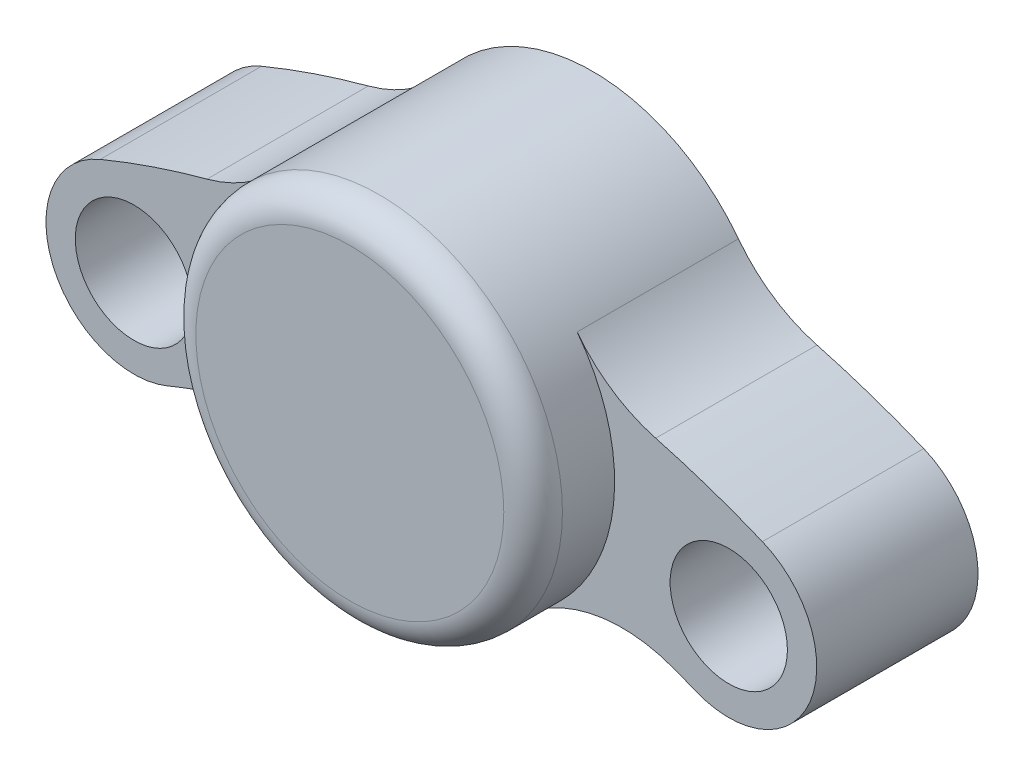
ISO-10303-21;
HEADER;
FILE_DESCRIPTION(('STEP AP214'),'2;1');
FILE_NAME('part.step','',(''),(''),'','','');
FILE_SCHEMA(('AUTOMOTIVE_DESIGN { 1 0 10303 214 1 1 1 1 }'));
ENDSEC;
DATA;
#1=APPLICATION_CONTEXT('core data for automotive mechanical design processes');
#2=APPLICATION_PROTOCOL_DEFINITION('international standard','automotive_design',2000,#1);
#3=PRODUCT_CONTEXT('',#1,'mechanical');
#4=PRODUCT('Part','Part','',(#3));
#5=PRODUCT_RELATED_PRODUCT_CATEGORY('part','',(#4));
#6=PRODUCT_DEFINITION_FORMATION('','',#4);
#7=PRODUCT_DEFINITION_CONTEXT('part definition',#1,'design');
#8=PRODUCT_DEFINITION('design','',#6,#7);
#9=PRODUCT_DEFINITION_SHAPE('','',#8);
#10=(LENGTH_UNIT() NAMED_UNIT(*) SI_UNIT(.MILLI.,.METRE.));
#11=(NAMED_UNIT(*) PLANE_ANGLE_UNIT() SI_UNIT($,.RADIAN.));
#12=(NAMED_UNIT(*) SI_UNIT($,.STERADIAN.) SOLID_ANGLE_UNIT());
#13=UNCERTAINTY_MEASURE_WITH_UNIT(LENGTH_MEASURE(1.E-05),#10,'distance_accuracy_value','');
#14=(GEOMETRIC_REPRESENTATION_CONTEXT(3) GLOBAL_UNCERTAINTY_ASSIGNED_CONTEXT((#13)) GLOBAL_UNIT_ASSIGNED_CONTEXT((#10,
#11,#12)) REPRESENTATION_CONTEXT('',''));
#15=CARTESIAN_POINT('',(0.,0.,0.));
#16=DIRECTION('',(0.,0.,1.));
#17=DIRECTION('',(1.,0.,0.));
#18=AXIS2_PLACEMENT_3D('',#15,#16,#17);
#19=CARTESIAN_POINT('',(0.,13.25,5.5));
#20=DIRECTION('',(0.,0.,1.));
#21=DIRECTION('',(1.,0.,0.));
#22=AXIS2_PLACEMENT_3D('',#19,#20,#21);
#23=PLANE('',#22);
#24=CARTESIAN_POINT('',(0.,26.5,5.5));
#25=DIRECTION('',(0.,0.,1.));
#26=DIRECTION('',(1.,0.,0.));
#27=AXIS2_PLACEMENT_3D('',#24,#25,#26);
#28=CIRCLE('',#27,6.25);
#29=CARTESIAN_POINT('',(-4.97077540669246,30.2886530398311,5.5));
#30=VERTEX_POINT('',#29);
#31=CARTESIAN_POINT('',(-3.61249142337962,21.3997641509428,5.5));
#32=VERTEX_POINT('',#31);
#33=EDGE_CURVE('E191',#30,#32,#28,.T.);
#34=ORIENTED_EDGE('',*,*,#33,.F.);
#35=CARTESIAN_POINT('',(-8.94739573204641,33.319575471696,5.5));
#36=DIRECTION('',(0.,0.,1.));
#37=DIRECTION('',(1.,0.,0.));
#38=AXIS2_PLACEMENT_3D('',#35,#36,#37);
#39=CIRCLE('',#38,5.);
#40=CARTESIAN_POINT('',(-7.65067171290919,28.4906514902905,5.5));
#41=VERTEX_POINT('',#40);
#42=EDGE_CURVE('E130',#30,#41,#39,.F.);
#43=ORIENTED_EDGE('',*,*,#42,.T.);
#44=CARTESIAN_POINT('',(0.,0.,5.5));
#45=DIRECTION('',(0.,0.,1.));
#46=DIRECTION('',(1.,0.,0.));
#47=AXIS2_PLACEMENT_3D('',#44,#45,#46);
#48=CIRCLE('',#47,29.4999999999983);
#49=CARTESIAN_POINT('',(-11.2891612547706,27.254446209081,5.5));
#50=VERTEX_POINT('',#49);
#51=EDGE_CURVE('E122',#41,#50,#48,.T.);
#52=ORIENTED_EDGE('',*,*,#51,.T.);
#53=CARTESIAN_POINT('',(-10.1411109576752,24.4828076115472,5.5));
#54=DIRECTION('',(0.,0.,1.));
#55=DIRECTION('',(1.,0.,0.));
#56=AXIS2_PLACEMENT_3D('',#53,#54,#55);
#57=CIRCLE('',#56,3.);
#58=CARTESIAN_POINT('',(-8.99306066057985,21.7111690140134,5.5));
#59=VERTEX_POINT('',#58);
#60=EDGE_CURVE('E127',#50,#59,#57,.T.);
#61=ORIENTED_EDGE('',*,*,#60,.T.);
#62=CARTESIAN_POINT('',(0.,0.,5.5));
#63=DIRECTION('',(0.,0.,-1.));
#64=DIRECTION('',(1.,0.,0.));
#65=AXIS2_PLACEMENT_3D('',#62,#63,#64);
#66=CIRCLE('',#65,23.4999999999983);
#67=CARTESIAN_POINT('',(-8.25991282210598,22.0005418153993,5.5));
#68=VERTEX_POINT('',#67);
#69=EDGE_CURVE('E149',#59,#68,#66,.T.);
#70=ORIENTED_EDGE('',*,*,#69,.T.);
#71=CARTESIAN_POINT('',(-6.50248456208331,17.319575471697,5.5));
#72=DIRECTION('',(0.,0.,1.));
#73=DIRECTION('',(1.,0.,0.));
#74=AXIS2_PLACEMENT_3D('',#71,#72,#73);
#75=CIRCLE('',#74,5.);
#76=EDGE_CURVE('E213',#68,#32,#75,.F.);
#77=ORIENTED_EDGE('',*,*,#76,.T.);
#78=EDGE_LOOP('',(#34,#43,#52,#61,#70,#77));
#79=FACE_BOUND('',#78,.T.);
#80=CARTESIAN_POINT('',(-10.1411109576752,24.4828076115472,5.5));
#81=DIRECTION('',(0.,0.,1.));
#82=DIRECTION('',(1.,0.,0.));
#83=AXIS2_PLACEMENT_3D('',#80,#81,#82);
#84=CIRCLE('',#83,2.);
#85=CARTESIAN_POINT('',(-8.14111095767523,24.4828076115472,5.5));
#86=VERTEX_POINT('',#85);
#87=EDGE_CURVE('E164',#86,#86,#84,.T.);
#88=ORIENTED_EDGE('',*,*,#87,.F.);
#89=EDGE_LOOP('',(#88));
#90=FACE_BOUND('',#89,.T.);
#91=ADVANCED_FACE('F33',(#79,#90),#23,.T.);
#92=CARTESIAN_POINT('',(3.61249142337962,21.3997641509428,5.5));
#93=VERTEX_POINT('',#92);
#94=CARTESIAN_POINT('',(4.97077540669246,30.2886530398311,5.5));
#95=VERTEX_POINT('',#94);
#96=EDGE_CURVE('E143',#93,#95,#28,.T.);
#97=ORIENTED_EDGE('',*,*,#96,.F.);
#98=CARTESIAN_POINT('',(6.50248456208331,17.319575471697,5.5));
#99=DIRECTION('',(0.,0.,1.));
#100=DIRECTION('',(1.,0.,0.));
#101=AXIS2_PLACEMENT_3D('',#98,#99,#100);
#102=CIRCLE('',#101,5.);
#103=CARTESIAN_POINT('',(8.25991282210598,22.0005418153993,5.5));
#104=VERTEX_POINT('',#103);
#105=EDGE_CURVE('E48',#93,#104,#102,.F.);
#106=ORIENTED_EDGE('',*,*,#105,.T.);
#107=CARTESIAN_POINT('',(0.,0.,5.5));
#108=DIRECTION('',(0.,0.,-1.));
#109=DIRECTION('',(1.,0.,0.));
#110=AXIS2_PLACEMENT_3D('',#107,#108,#109);
#111=CIRCLE('',#110,23.4999999999983);
#112=CARTESIAN_POINT('',(8.99306066057865,21.7111690140138,5.5));
#113=VERTEX_POINT('',#112);
#114=EDGE_CURVE('E151',#104,#113,#111,.T.);
#115=ORIENTED_EDGE('',*,*,#114,.T.);
#116=CARTESIAN_POINT('',(10.1411109576745,24.4828076115492,5.5));
#117=DIRECTION('',(0.,0.,1.));
#118=DIRECTION('',(1.,0.,0.));
#119=AXIS2_PLACEMENT_3D('',#116,#117,#118);
#120=CIRCLE('',#119,3.);
#121=CARTESIAN_POINT('',(11.2891612547697,27.2544462090831,5.5));
#122=VERTEX_POINT('',#121);
#123=EDGE_CURVE('E157',#113,#122,#120,.T.);
#124=ORIENTED_EDGE('',*,*,#123,.T.);
#125=CARTESIAN_POINT('',(0.,0.,5.5));
#126=DIRECTION('',(0.,0.,1.));
#127=DIRECTION('',(1.,0.,0.));
#128=AXIS2_PLACEMENT_3D('',#125,#126,#127);
#129=CIRCLE('',#128,29.4999999999983);
#130=CARTESIAN_POINT('',(7.65067171290921,28.4906514902905,5.5));
#131=VERTEX_POINT('',#130);
#132=EDGE_CURVE('E134',#122,#131,#129,.T.);
#133=ORIENTED_EDGE('',*,*,#132,.T.);
#134=CARTESIAN_POINT('',(8.94739573204644,33.319575471696,5.5));
#135=DIRECTION('',(0.,0.,1.));
#136=DIRECTION('',(1.,0.,0.));
#137=AXIS2_PLACEMENT_3D('',#134,#135,#136);
#138=CIRCLE('',#137,5.);
#139=EDGE_CURVE('E205',#131,#95,#138,.F.);
#140=ORIENTED_EDGE('',*,*,#139,.T.);
#141=EDGE_LOOP('',(#97,#106,#115,#124,#133,#140));
#142=FACE_BOUND('',#141,.T.);
#143=CARTESIAN_POINT('',(10.1411109576745,24.4828076115492,5.5));
#144=DIRECTION('',(0.,0.,1.));
#145=DIRECTION('',(1.,0.,0.));
#146=AXIS2_PLACEMENT_3D('',#143,#144,#145);
#147=CIRCLE('',#146,2.);
#148=CARTESIAN_POINT('',(12.1411109576745,24.4828076115492,5.5));
#149=VERTEX_POINT('',#148);
#150=EDGE_CURVE('E324',#149,#149,#147,.T.);
#151=ORIENTED_EDGE('',*,*,#150,.F.);
#152=EDGE_LOOP('',(#151));
#153=FACE_BOUND('',#152,.T.);
#154=ADVANCED_FACE('F231',(#142,#153),#23,.T.);
#155=CARTESIAN_POINT('',(0.,13.25,0.));
#156=DIRECTION('',(0.,0.,1.));
#157=DIRECTION('',(1.,0.,0.));
#158=AXIS2_PLACEMENT_3D('',#155,#156,#157);
#159=PLANE('',#158);
#160=CARTESIAN_POINT('',(10.1411109576745,24.4828076115492,0.));
#161=DIRECTION('',(0.,0.,1.));
#162=DIRECTION('',(1.,0.,0.));
#163=AXIS2_PLACEMENT_3D('',#160,#161,#162);
#164=CIRCLE('',#163,2.);
#165=CARTESIAN_POINT('',(12.1411109576745,24.4828076115492,0.));
#166=VERTEX_POINT('',#165);
#167=EDGE_CURVE('E326',#166,#166,#164,.T.);
#168=ORIENTED_EDGE('',*,*,#167,.T.);
#169=EDGE_LOOP('',(#168));
#170=FACE_BOUND('',#169,.T.);
#171=CARTESIAN_POINT('',(0.,0.,0.));
#172=DIRECTION('',(0.,0.,1.));
#173=DIRECTION('',(1.,0.,0.));
#174=AXIS2_PLACEMENT_3D('',#171,#172,#173);
#175=CIRCLE('',#174,29.4999999999983);
#176=CARTESIAN_POINT('',(11.2891612547697,27.2544462090831,0.));
#177=VERTEX_POINT('',#176);
#178=CARTESIAN_POINT('',(7.65067171290921,28.4906514902905,0.));
#179=VERTEX_POINT('',#178);
#180=EDGE_CURVE('E160',#177,#179,#175,.T.);
#181=ORIENTED_EDGE('',*,*,#180,.F.);
#182=CARTESIAN_POINT('',(10.1411109576745,24.4828076115492,0.));
#183=DIRECTION('',(0.,0.,1.));
#184=DIRECTION('',(1.,0.,0.));
#185=AXIS2_PLACEMENT_3D('',#182,#183,#184);
#186=CIRCLE('',#185,3.);
#187=CARTESIAN_POINT('',(8.99306066057865,21.7111690140138,0.));
#188=VERTEX_POINT('',#187);
#189=EDGE_CURVE('E178',#188,#177,#186,.T.);
#190=ORIENTED_EDGE('',*,*,#189,.F.);
#191=CARTESIAN_POINT('',(0.,0.,0.));
#192=DIRECTION('',(0.,0.,-1.));
#193=DIRECTION('',(1.,0.,0.));
#194=AXIS2_PLACEMENT_3D('',#191,#192,#193);
#195=CIRCLE('',#194,23.4999999999983);
#196=CARTESIAN_POINT('',(8.25991282210598,22.0005418153993,0.));
#197=VERTEX_POINT('',#196);
#198=EDGE_CURVE('E176',#197,#188,#195,.T.);
#199=ORIENTED_EDGE('',*,*,#198,.F.);
#200=CARTESIAN_POINT('',(6.50248456208331,17.319575471697,0.));
#201=DIRECTION('',(0.,0.,1.));
#202=DIRECTION('',(1.,0.,0.));
#203=AXIS2_PLACEMENT_3D('',#200,#201,#202);
#204=CIRCLE('',#203,5.);
#205=CARTESIAN_POINT('',(3.61249142337962,21.3997641509428,0.));
#206=VERTEX_POINT('',#205);
#207=EDGE_CURVE('E56',#197,#206,#204,.T.);
#208=ORIENTED_EDGE('',*,*,#207,.T.);
#209=CARTESIAN_POINT('',(0.,26.5,0.));
#210=DIRECTION('',(0.,0.,1.));
#211=DIRECTION('',(1.,0.,0.));
#212=AXIS2_PLACEMENT_3D('',#209,#210,#211);
#213=CIRCLE('',#212,6.25);
#214=CARTESIAN_POINT('',(-3.61249142337962,21.3997641509428,0.));
#215=VERTEX_POINT('',#214);
#216=EDGE_CURVE('E173',#215,#206,#213,.T.);
#217=ORIENTED_EDGE('',*,*,#216,.F.);
#218=CARTESIAN_POINT('',(-6.50248456208331,17.319575471697,0.));
#219=DIRECTION('',(0.,0.,1.));
#220=DIRECTION('',(1.,0.,0.));
#221=AXIS2_PLACEMENT_3D('',#218,#219,#220);
#222=CIRCLE('',#221,5.);
#223=CARTESIAN_POINT('',(-8.25991282210598,22.0005418153993,0.));
#224=VERTEX_POINT('',#223);
#225=EDGE_CURVE('E211',#215,#224,#222,.T.);
#226=ORIENTED_EDGE('',*,*,#225,.T.);
#227=CARTESIAN_POINT('',(0.,0.,0.));
#228=DIRECTION('',(0.,0.,-1.));
#229=DIRECTION('',(1.,0.,0.));
#230=AXIS2_PLACEMENT_3D('',#227,#228,#229);
#231=CIRCLE('',#230,23.4999999999983);
#232=CARTESIAN_POINT('',(-8.99306066057985,21.7111690140134,0.));
#233=VERTEX_POINT('',#232);
#234=EDGE_CURVE('E170',#233,#224,#231,.T.);
#235=ORIENTED_EDGE('',*,*,#234,.F.);
#236=CARTESIAN_POINT('',(-10.1411109576752,24.4828076115472,0.));
#237=DIRECTION('',(0.,0.,1.));
#238=DIRECTION('',(1.,0.,0.));
#239=AXIS2_PLACEMENT_3D('',#236,#237,#238);
#240=CIRCLE('',#239,3.);
#241=CARTESIAN_POINT('',(-11.2891612547706,27.254446209081,0.));
#242=VERTEX_POINT('',#241);
#243=EDGE_CURVE('E168',#242,#233,#240,.T.);
#244=ORIENTED_EDGE('',*,*,#243,.F.);
#245=CARTESIAN_POINT('',(0.,0.,0.));
#246=DIRECTION('',(0.,0.,1.));
#247=DIRECTION('',(1.,0.,0.));
#248=AXIS2_PLACEMENT_3D('',#245,#246,#247);
#249=CIRCLE('',#248,29.4999999999983);
#250=CARTESIAN_POINT('',(-7.65067171290919,28.4906514902905,0.));
#251=VERTEX_POINT('',#250);
#252=EDGE_CURVE('E140',#251,#242,#249,.T.);
#253=ORIENTED_EDGE('',*,*,#252,.F.);
#254=CARTESIAN_POINT('',(-8.94739573204641,33.319575471696,0.));
#255=DIRECTION('',(0.,0.,1.));
#256=DIRECTION('',(1.,0.,0.));
#257=AXIS2_PLACEMENT_3D('',#254,#255,#256);
#258=CIRCLE('',#257,5.);
#259=CARTESIAN_POINT('',(-4.97077540669246,30.2886530398311,0.));
#260=VERTEX_POINT('',#259);
#261=EDGE_CURVE('E208',#251,#260,#258,.T.);
#262=ORIENTED_EDGE('',*,*,#261,.T.);
#263=CARTESIAN_POINT('',(0.,26.5,0.));
#264=DIRECTION('',(0.,0.,1.));
#265=DIRECTION('',(1.,0.,0.));
#266=AXIS2_PLACEMENT_3D('',#263,#264,#265);
#267=CIRCLE('',#266,6.25);
#268=CARTESIAN_POINT('',(4.97077540669246,30.2886530398311,0.));
#269=VERTEX_POINT('',#268);
#270=EDGE_CURVE('E163',#269,#260,#267,.T.);
#271=ORIENTED_EDGE('',*,*,#270,.F.);
#272=CARTESIAN_POINT('',(8.94739573204644,33.319575471696,0.));
#273=DIRECTION('',(0.,0.,1.));
#274=DIRECTION('',(1.,0.,0.));
#275=AXIS2_PLACEMENT_3D('',#272,#273,#274);
#276=CIRCLE('',#275,5.);
#277=EDGE_CURVE('E203',#269,#179,#276,.T.);
#278=ORIENTED_EDGE('',*,*,#277,.T.);
#279=EDGE_LOOP('',(#181,#190,#199,#208,#217,#226,#235,#244,#253,#262,#271,#278));
#280=FACE_BOUND('',#279,.T.);
#281=CARTESIAN_POINT('',(-10.1411109576752,24.4828076115472,0.));
#282=DIRECTION('',(0.,0.,1.));
#283=DIRECTION('',(1.,0.,0.));
#284=AXIS2_PLACEMENT_3D('',#281,#282,#283);
#285=CIRCLE('',#284,2.);
#286=CARTESIAN_POINT('',(-8.14111095767523,24.4828076115472,0.));
#287=VERTEX_POINT('',#286);
#288=EDGE_CURVE('E155',#287,#287,#285,.T.);
#289=ORIENTED_EDGE('',*,*,#288,.T.);
#290=EDGE_LOOP('',(#289));
#291=FACE_BOUND('',#290,.T.);
#292=CARTESIAN_POINT('',(0.,26.5,0.));
#293=DIRECTION('',(0.,0.,1.));
#294=DIRECTION('',(1.,0.,0.));
#295=AXIS2_PLACEMENT_3D('',#292,#293,#294);
#296=CIRCLE('',#295,5.125);
#297=CARTESIAN_POINT('',(5.125,26.5,0.));
#298=VERTEX_POINT('',#297);
#299=EDGE_CURVE('E330',#298,#298,#296,.T.);
#300=ORIENTED_EDGE('',*,*,#299,.T.);
#301=EDGE_LOOP('',(#300));
#302=FACE_BOUND('',#301,.T.);
#303=ADVANCED_FACE('F236',(#170,#280,#291,#302),#159,.F.);
#304=CARTESIAN_POINT('',(0.,0.,5.5));
#305=DIRECTION('',(0.,0.,-1.));
#306=DIRECTION('',(-1.,0.,0.));
#307=AXIS2_PLACEMENT_3D('',#304,#305,#306);
#308=CYLINDRICAL_SURFACE('',#307,29.4999999999983);
#309=ORIENTED_EDGE('',*,*,#180,.T.);
#310=DIRECTION('',(0.,0.,-1.));
#311=VECTOR('',#310,1.);
#312=CARTESIAN_POINT('',(7.65067171290921,28.4906514902905,5.5));
#313=LINE('',#312,#311);
#314=EDGE_CURVE('E289',#179,#131,#313,.F.);
#315=ORIENTED_EDGE('',*,*,#314,.T.);
#316=ORIENTED_EDGE('',*,*,#132,.F.);
#317=DIRECTION('',(0.,0.,-1.));
#318=VECTOR('',#317,1.);
#319=CARTESIAN_POINT('',(11.2891612547697,27.2544462090831,5.5));
#320=LINE('',#319,#318);
#321=EDGE_CURVE('E159',#122,#177,#320,.T.);
#322=ORIENTED_EDGE('',*,*,#321,.T.);
#323=EDGE_LOOP('',(#309,#315,#316,#322));
#324=FACE_BOUND('',#323,.T.);
#325=ADVANCED_FACE('F243',(#324),#308,.T.);
#326=CARTESIAN_POINT('',(0.,0.,5.5));
#327=DIRECTION('',(0.,0.,-1.));
#328=DIRECTION('',(-1.,0.,0.));
#329=AXIS2_PLACEMENT_3D('',#326,#327,#328);
#330=CYLINDRICAL_SURFACE('',#329,29.4999999999983);
#331=ORIENTED_EDGE('',*,*,#51,.F.);
#332=DIRECTION('',(0.,0.,-1.));
#333=VECTOR('',#332,1.);
#334=CARTESIAN_POINT('',(-7.65067171290919,28.4906514902905,5.5));
#335=LINE('',#334,#333);
#336=EDGE_CURVE('E288',#41,#251,#335,.T.);
#337=ORIENTED_EDGE('',*,*,#336,.T.);
#338=ORIENTED_EDGE('',*,*,#252,.T.);
#339=DIRECTION('',(0.,0.,-1.));
#340=VECTOR('',#339,1.);
#341=CARTESIAN_POINT('',(-11.2891612547706,27.254446209081,5.5));
#342=LINE('',#341,#340);
#343=EDGE_CURVE('E137',#50,#242,#342,.T.);
#344=ORIENTED_EDGE('',*,*,#343,.F.);
#345=EDGE_LOOP('',(#331,#337,#338,#344));
#346=FACE_BOUND('',#345,.T.);
#347=ADVANCED_FACE('F138',(#346),#330,.T.);
#348=CARTESIAN_POINT('',(-10.1411109576752,24.4828076115472,5.5));
#349=DIRECTION('',(0.,0.,-1.));
#350=DIRECTION('',(-1.,0.,0.));
#351=AXIS2_PLACEMENT_3D('',#348,#349,#350);
#352=CYLINDRICAL_SURFACE('',#351,3.);
#353=ORIENTED_EDGE('',*,*,#243,.T.);
#354=DIRECTION('',(0.,0.,-1.));
#355=VECTOR('',#354,1.);
#356=CARTESIAN_POINT('',(-8.99306066057985,21.7111690140134,5.5));
#357=LINE('',#356,#355);
#358=EDGE_CURVE('E144',#59,#233,#357,.T.);
#359=ORIENTED_EDGE('',*,*,#358,.F.);
#360=ORIENTED_EDGE('',*,*,#60,.F.);
#361=ORIENTED_EDGE('',*,*,#343,.T.);
#362=EDGE_LOOP('',(#353,#359,#360,#361));
#363=FACE_BOUND('',#362,.T.);
#364=ADVANCED_FACE('F146',(#363),#352,.T.);
#365=CARTESIAN_POINT('',(0.,0.,5.5));
#366=DIRECTION('',(0.,0.,-1.));
#367=DIRECTION('',(-1.,0.,0.));
#368=AXIS2_PLACEMENT_3D('',#365,#366,#367);
#369=CYLINDRICAL_SURFACE('',#368,23.4999999999983);
#370=ORIENTED_EDGE('',*,*,#234,.T.);
#371=DIRECTION('',(0.,0.,-1.));
#372=VECTOR('',#371,1.);
#373=CARTESIAN_POINT('',(-8.25991282210598,22.0005418153993,5.5));
#374=LINE('',#373,#372);
#375=EDGE_CURVE('E199',#224,#68,#374,.F.);
#376=ORIENTED_EDGE('',*,*,#375,.T.);
#377=ORIENTED_EDGE('',*,*,#69,.F.);
#378=ORIENTED_EDGE('',*,*,#358,.T.);
#379=EDGE_LOOP('',(#370,#376,#377,#378));
#380=FACE_BOUND('',#379,.T.);
#381=ADVANCED_FACE('F256',(#380),#369,.F.);
#382=CARTESIAN_POINT('',(0.,26.5,5.5));
#383=DIRECTION('',(0.,0.,-1.));
#384=DIRECTION('',(-1.,0.,0.));
#385=AXIS2_PLACEMENT_3D('',#382,#383,#384);
#386=CYLINDRICAL_SURFACE('',#385,6.25);
#387=CARTESIAN_POINT('',(0.,26.5,7.28));
#388=DIRECTION('',(0.,0.,1.));
#389=DIRECTION('',(1.,0.,0.));
#390=AXIS2_PLACEMENT_3D('',#387,#388,#389);
#391=CIRCLE('',#390,6.25);
#392=CARTESIAN_POINT('',(6.25,26.5,7.28));
#393=VERTEX_POINT('',#392);
#394=EDGE_CURVE('E11',#393,#393,#391,.F.);
#395=ORIENTED_EDGE('',*,*,#394,.T.);
#396=EDGE_LOOP('',(#395));
#397=FACE_BOUND('',#396,.T.);
#398=ORIENTED_EDGE('',*,*,#96,.T.);
#399=DIRECTION('',(0.,0.,-1.));
#400=VECTOR('',#399,1.);
#401=CARTESIAN_POINT('',(4.97077540669246,30.2886530398311,5.5));
#402=LINE('',#401,#400);
#403=EDGE_CURVE('E290',#95,#269,#402,.T.);
#404=ORIENTED_EDGE('',*,*,#403,.T.);
#405=ORIENTED_EDGE('',*,*,#270,.T.);
#406=DIRECTION('',(0.,0.,-1.));
#407=VECTOR('',#406,1.);
#408=CARTESIAN_POINT('',(-4.97077540669246,30.2886530398311,5.5));
#409=LINE('',#408,#407);
#410=EDGE_CURVE('E302',#260,#30,#409,.F.);
#411=ORIENTED_EDGE('',*,*,#410,.T.);
#412=ORIENTED_EDGE('',*,*,#33,.T.);
#413=DIRECTION('',(0.,0.,-1.));
#414=VECTOR('',#413,1.);
#415=CARTESIAN_POINT('',(-3.61249142337962,21.3997641509428,5.5));
#416=LINE('',#415,#414);
#417=EDGE_CURVE('E285',#32,#215,#416,.T.);
#418=ORIENTED_EDGE('',*,*,#417,.T.);
#419=ORIENTED_EDGE('',*,*,#216,.T.);
#420=DIRECTION('',(0.,0.,-1.));
#421=VECTOR('',#420,1.);
#422=CARTESIAN_POINT('',(3.61249142337962,21.3997641509428,5.5));
#423=LINE('',#422,#421);
#424=EDGE_CURVE('E298',#206,#93,#423,.F.);
#425=ORIENTED_EDGE('',*,*,#424,.T.);
#426=EDGE_LOOP('',(#398,#404,#405,#411,#412,#418,#419,#425));
#427=FACE_BOUND('',#426,.T.);
#428=ADVANCED_FACE('F252',(#397,#427),#386,.T.);
#429=CARTESIAN_POINT('',(0.,0.,5.5));
#430=DIRECTION('',(0.,0.,-1.));
#431=DIRECTION('',(-1.,0.,0.));
#432=AXIS2_PLACEMENT_3D('',#429,#430,#431);
#433=CYLINDRICAL_SURFACE('',#432,23.4999999999983);
#434=ORIENTED_EDGE('',*,*,#114,.F.);
#435=DIRECTION('',(0.,0.,-1.));
#436=VECTOR('',#435,1.);
#437=CARTESIAN_POINT('',(8.25991282210598,22.0005418153993,5.5));
#438=LINE('',#437,#436);
#439=EDGE_CURVE('E201',#104,#197,#438,.T.);
#440=ORIENTED_EDGE('',*,*,#439,.T.);
#441=ORIENTED_EDGE('',*,*,#198,.T.);
#442=DIRECTION('',(0.,0.,-1.));
#443=VECTOR('',#442,1.);
#444=CARTESIAN_POINT('',(8.99306066057865,21.7111690140138,5.5));
#445=LINE('',#444,#443);
#446=EDGE_CURVE('E182',#113,#188,#445,.T.);
#447=ORIENTED_EDGE('',*,*,#446,.F.);
#448=EDGE_LOOP('',(#434,#440,#441,#447));
#449=FACE_BOUND('',#448,.T.);
#450=ADVANCED_FACE('F248',(#449),#433,.F.);
#451=CARTESIAN_POINT('',(10.1411109576745,24.4828076115492,5.5));
#452=DIRECTION('',(0.,0.,-1.));
#453=DIRECTION('',(-1.,0.,0.));
#454=AXIS2_PLACEMENT_3D('',#451,#452,#453);
#455=CYLINDRICAL_SURFACE('',#454,3.);
#456=ORIENTED_EDGE('',*,*,#189,.T.);
#457=ORIENTED_EDGE('',*,*,#321,.F.);
#458=ORIENTED_EDGE('',*,*,#123,.F.);
#459=ORIENTED_EDGE('',*,*,#446,.T.);
#460=EDGE_LOOP('',(#456,#457,#458,#459));
#461=FACE_BOUND('',#460,.T.);
#462=ADVANCED_FACE('F245',(#461),#455,.T.);
#463=CARTESIAN_POINT('',(-10.1411109576752,24.4828076115472,5.5));
#464=DIRECTION('',(0.,0.,-1.));
#465=DIRECTION('',(-1.,0.,0.));
#466=AXIS2_PLACEMENT_3D('',#463,#464,#465);
#467=CYLINDRICAL_SURFACE('',#466,2.);
#468=ORIENTED_EDGE('',*,*,#87,.T.);
#469=EDGE_LOOP('',(#468));
#470=FACE_BOUND('',#469,.T.);
#471=ORIENTED_EDGE('',*,*,#288,.F.);
#472=EDGE_LOOP('',(#471));
#473=FACE_BOUND('',#472,.T.);
#474=ADVANCED_FACE('F239',(#470,#473),#467,.F.);
#475=CARTESIAN_POINT('',(10.1411109576745,24.4828076115492,5.5));
#476=DIRECTION('',(0.,0.,-1.));
#477=DIRECTION('',(-1.,0.,0.));
#478=AXIS2_PLACEMENT_3D('',#475,#476,#477);
#479=CYLINDRICAL_SURFACE('',#478,2.);
#480=ORIENTED_EDGE('',*,*,#150,.T.);
#481=EDGE_LOOP('',(#480));
#482=FACE_BOUND('',#481,.T.);
#483=ORIENTED_EDGE('',*,*,#167,.F.);
#484=EDGE_LOOP('',(#483));
#485=FACE_BOUND('',#484,.T.);
#486=ADVANCED_FACE('F339',(#482,#485),#479,.F.);
#487=CARTESIAN_POINT('',(0.,26.5,5.5));
#488=DIRECTION('',(0.,0.,-1.));
#489=DIRECTION('',(-1.,0.,0.));
#490=AXIS2_PLACEMENT_3D('',#487,#488,#489);
#491=CYLINDRICAL_SURFACE('',#490,5.125);
#492=ORIENTED_EDGE('',*,*,#299,.F.);
#493=EDGE_LOOP('',(#492));
#494=FACE_BOUND('',#493,.T.);
#495=CARTESIAN_POINT('',(0.,26.5,6.78));
#496=DIRECTION('',(0.,0.,1.));
#497=DIRECTION('',(1.,0.,0.));
#498=AXIS2_PLACEMENT_3D('',#495,#496,#497);
#499=CIRCLE('',#498,5.125);
#500=CARTESIAN_POINT('',(5.125,26.5,6.78));
#501=VERTEX_POINT('',#500);
#502=EDGE_CURVE('E345',#501,#501,#499,.T.);
#503=ORIENTED_EDGE('',*,*,#502,.T.);
#504=EDGE_LOOP('',(#503));
#505=FACE_BOUND('',#504,.T.);
#506=ADVANCED_FACE('F349',(#494,#505),#491,.F.);
#507=CARTESIAN_POINT('',(0.,26.5,8.28));
#508=DIRECTION('',(0.,0.,1.));
#509=DIRECTION('',(1.,0.,0.));
#510=AXIS2_PLACEMENT_3D('',#507,#508,#509);
#511=PLANE('',#510);
#512=CARTESIAN_POINT('',(0.,26.5,8.28));
#513=DIRECTION('',(0.,0.,1.));
#514=DIRECTION('',(1.,0.,0.));
#515=AXIS2_PLACEMENT_3D('',#512,#513,#514);
#516=CIRCLE('',#515,5.25);
#517=CARTESIAN_POINT('',(5.25,26.5,8.28));
#518=VERTEX_POINT('',#517);
#519=EDGE_CURVE('E41',#518,#518,#516,.T.);
#520=ORIENTED_EDGE('',*,*,#519,.T.);
#521=EDGE_LOOP('',(#520));
#522=FACE_BOUND('',#521,.T.);
#523=ADVANCED_FACE('F220',(#522),#511,.T.);
#524=CARTESIAN_POINT('',(0.,26.5,6.78));
#525=DIRECTION('',(0.,0.,1.));
#526=DIRECTION('',(1.,0.,0.));
#527=AXIS2_PLACEMENT_3D('',#524,#525,#526);
#528=PLANE('',#527);
#529=ORIENTED_EDGE('',*,*,#502,.F.);
#530=EDGE_LOOP('',(#529));
#531=FACE_BOUND('',#530,.T.);
#532=ADVANCED_FACE('F272',(#531),#528,.F.);
#533=CARTESIAN_POINT('',(8.94739573204644,33.319575471696,5.5));
#534=DIRECTION('',(0.,0.,1.));
#535=DIRECTION('',(1.,0.,0.));
#536=AXIS2_PLACEMENT_3D('',#533,#534,#535);
#537=CYLINDRICAL_SURFACE('',#536,5.);
#538=ORIENTED_EDGE('',*,*,#139,.F.);
#539=ORIENTED_EDGE('',*,*,#314,.F.);
#540=ORIENTED_EDGE('',*,*,#277,.F.);
#541=ORIENTED_EDGE('',*,*,#403,.F.);
#542=EDGE_LOOP('',(#538,#539,#540,#541));
#543=FACE_BOUND('',#542,.T.);
#544=ADVANCED_FACE('F268',(#543),#537,.F.);
#545=CARTESIAN_POINT('',(-8.94739573204641,33.319575471696,5.5));
#546=DIRECTION('',(0.,0.,1.));
#547=DIRECTION('',(1.,0.,0.));
#548=AXIS2_PLACEMENT_3D('',#545,#546,#547);
#549=CYLINDRICAL_SURFACE('',#548,5.);
#550=ORIENTED_EDGE('',*,*,#42,.F.);
#551=ORIENTED_EDGE('',*,*,#410,.F.);
#552=ORIENTED_EDGE('',*,*,#261,.F.);
#553=ORIENTED_EDGE('',*,*,#336,.F.);
#554=EDGE_LOOP('',(#550,#551,#552,#553));
#555=FACE_BOUND('',#554,.T.);
#556=ADVANCED_FACE('F271',(#555),#549,.F.);
#557=CARTESIAN_POINT('',(-6.50248456208331,17.319575471697,5.5));
#558=DIRECTION('',(0.,0.,-1.));
#559=DIRECTION('',(-1.,0.,0.));
#560=AXIS2_PLACEMENT_3D('',#557,#558,#559);
#561=CYLINDRICAL_SURFACE('',#560,5.);
#562=ORIENTED_EDGE('',*,*,#76,.F.);
#563=ORIENTED_EDGE('',*,*,#375,.F.);
#564=ORIENTED_EDGE('',*,*,#225,.F.);
#565=ORIENTED_EDGE('',*,*,#417,.F.);
#566=EDGE_LOOP('',(#562,#563,#564,#565));
#567=FACE_BOUND('',#566,.T.);
#568=ADVANCED_FACE('F228',(#567),#561,.F.);
#569=CARTESIAN_POINT('',(6.50248456208331,17.319575471697,5.5));
#570=DIRECTION('',(0.,0.,-1.));
#571=DIRECTION('',(-1.,0.,0.));
#572=AXIS2_PLACEMENT_3D('',#569,#570,#571);
#573=CYLINDRICAL_SURFACE('',#572,5.);
#574=ORIENTED_EDGE('',*,*,#105,.F.);
#575=ORIENTED_EDGE('',*,*,#424,.F.);
#576=ORIENTED_EDGE('',*,*,#207,.F.);
#577=ORIENTED_EDGE('',*,*,#439,.F.);
#578=EDGE_LOOP('',(#574,#575,#576,#577));
#579=FACE_BOUND('',#578,.T.);
#580=ADVANCED_FACE('F223',(#579),#573,.F.);
#581=CARTESIAN_POINT('',(0.,26.5,7.28));
#582=DIRECTION('',(0.,0.,1.));
#583=DIRECTION('',(1.,0.,0.));
#584=AXIS2_PLACEMENT_3D('',#581,#582,#583);
#585=TOROIDAL_SURFACE('',#584,5.25,1.);
#586=ORIENTED_EDGE('',*,*,#394,.F.);
#587=EDGE_LOOP('',(#586));
#588=FACE_BOUND('',#587,.T.);
#589=ORIENTED_EDGE('',*,*,#519,.F.);
#590=EDGE_LOOP('',(#589));
#591=FACE_BOUND('',#590,.T.);
#592=ADVANCED_FACE('F35',(#588,#591),#585,.T.);
#593=CLOSED_SHELL('',(#91,#154,#303,#325,#347,#364,#381,#428,#450,#462,#474,#486,#506,#523,#532,
#544,#556,#568,#580,#592));
#594=MANIFOLD_SOLID_BREP('B2',#593);
#595=ADVANCED_BREP_SHAPE_REPRESENTATION('',(#18,#594),#14);
#596=SHAPE_DEFINITION_REPRESENTATION(#9,#595);
ENDSEC;
END-ISO-10303-21;
